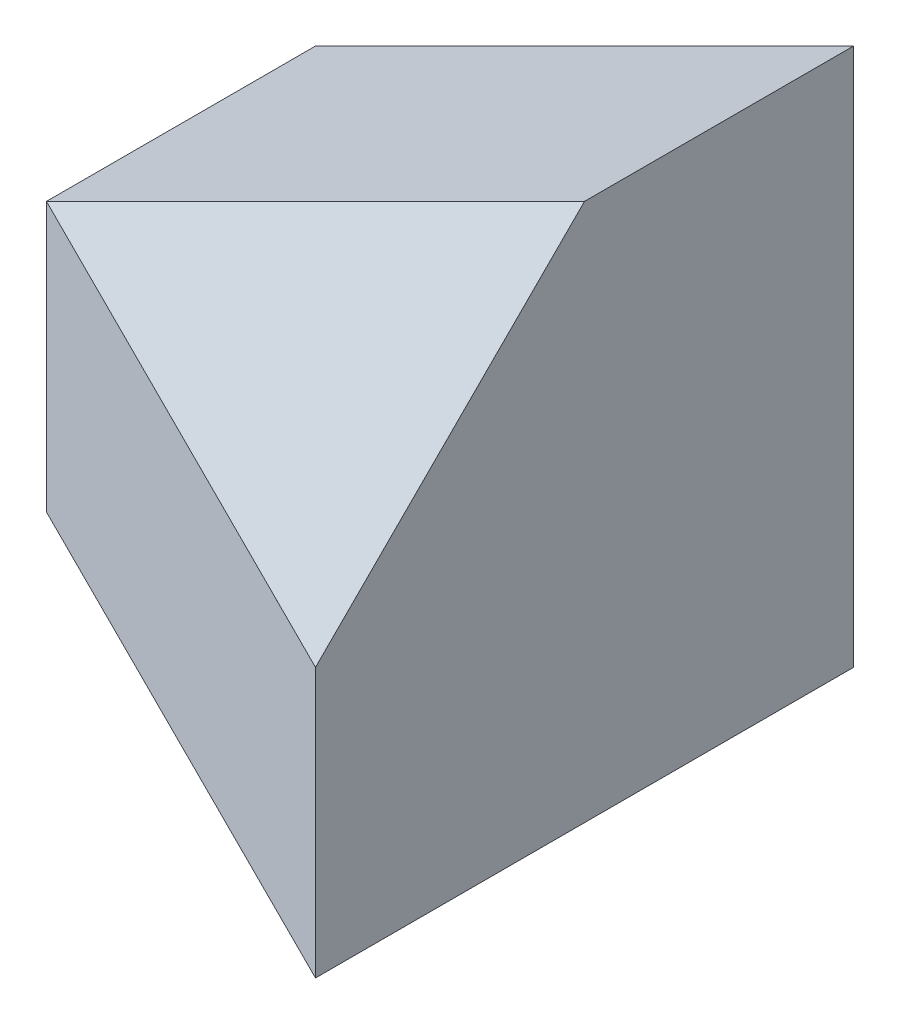
ISO-10303-21;
HEADER;
FILE_DESCRIPTION(('STEP AP214'),'2;1');
FILE_NAME('part.step','',(''),(''),'','','');
FILE_SCHEMA(('AUTOMOTIVE_DESIGN { 1 0 10303 214 1 1 1 1 }'));
ENDSEC;
DATA;
#1=APPLICATION_CONTEXT('core data for automotive mechanical design processes');
#2=APPLICATION_PROTOCOL_DEFINITION('international standard','automotive_design',2000,#1);
#3=PRODUCT_CONTEXT('',#1,'mechanical');
#4=PRODUCT('Part','Part','',(#3));
#5=PRODUCT_RELATED_PRODUCT_CATEGORY('part','',(#4));
#6=PRODUCT_DEFINITION_FORMATION('','',#4);
#7=PRODUCT_DEFINITION_CONTEXT('part definition',#1,'design');
#8=PRODUCT_DEFINITION('design','',#6,#7);
#9=PRODUCT_DEFINITION_SHAPE('','',#8);
#10=(LENGTH_UNIT() NAMED_UNIT(*) SI_UNIT(.MILLI.,.METRE.));
#11=(NAMED_UNIT(*) PLANE_ANGLE_UNIT() SI_UNIT($,.RADIAN.));
#12=(NAMED_UNIT(*) SI_UNIT($,.STERADIAN.) SOLID_ANGLE_UNIT());
#13=UNCERTAINTY_MEASURE_WITH_UNIT(LENGTH_MEASURE(1.E-05),#10,'distance_accuracy_value','');
#14=(GEOMETRIC_REPRESENTATION_CONTEXT(3) GLOBAL_UNCERTAINTY_ASSIGNED_CONTEXT((#13)) GLOBAL_UNIT_ASSIGNED_CONTEXT((#10,
#11,#12)) REPRESENTATION_CONTEXT('',''));
#15=CARTESIAN_POINT('',(0.,0.,0.));
#16=DIRECTION('',(0.,0.,1.));
#17=DIRECTION('',(1.,0.,0.));
#18=AXIS2_PLACEMENT_3D('',#15,#16,#17);
#19=CARTESIAN_POINT('',(-7.99995527864045,0.,15.9999105572809));
#20=DIRECTION('',(0.447213595499958,0.,-0.894427190999916));
#21=DIRECTION('',(-0.894427190999916,0.,-0.447213595499958));
#22=AXIS2_PLACEMENT_3D('',#19,#20,#21);
#23=PLANE('',#22);
#24=DIRECTION('',(-0.894427190999916,0.,-0.447213595499958));
#25=VECTOR('',#24,1.);
#26=CARTESIAN_POINT('',(4.47213595447916E-05,20.001,19.9999105572809));
#27=LINE('',#26,#25);
#28=CARTESIAN_POINT('',(40.,20.001,39.9998881966011));
#29=VERTEX_POINT('',#28);
#30=CARTESIAN_POINT('',(0.,20.0009105572809,20.0007881966011));
#31=VERTEX_POINT('',#30);
#32=EDGE_CURVE('E131',#29,#31,#27,.T.);
#33=ORIENTED_EDGE('',*,*,#32,.T.);
#34=DIRECTION('',(0.894427190999916,0.,0.447213595499958));
#35=VECTOR('',#34,1.);
#36=CARTESIAN_POINT('',(4.47213595447916E-05,20.,19.9999105572809));
#37=LINE('',#36,#35);
#38=CARTESIAN_POINT('',(40.,20.,39.9998881966011));
#39=VERTEX_POINT('',#38);
#40=EDGE_CURVE('E193',#31,#39,#37,.T.);
#41=ORIENTED_EDGE('',*,*,#40,.T.);
#42=DIRECTION('',(0.,-1.,0.));
#43=VECTOR('',#42,1.);
#44=CARTESIAN_POINT('',(40.,0.,39.9998881966011));
#45=LINE('',#44,#43);
#46=EDGE_CURVE('E80',#29,#39,#45,.T.);
#47=ORIENTED_EDGE('',*,*,#46,.F.);
#48=EDGE_LOOP('',(#33,#41,#47));
#49=FACE_BOUND('',#48,.T.);
#50=ADVANCED_FACE('F53',(#49),#23,.F.);
#51=CARTESIAN_POINT('',(40.,0.,40.));
#52=DIRECTION('',(-1.,0.,0.));
#53=DIRECTION('',(0.,0.,1.));
#54=AXIS2_PLACEMENT_3D('',#51,#52,#53);
#55=PLANE('',#54);
#56=DIRECTION('',(0.,1.,0.));
#57=VECTOR('',#56,1.);
#58=CARTESIAN_POINT('',(40.,20.0009105572809,0.));
#59=LINE('',#58,#57);
#60=CARTESIAN_POINT('',(40.,20.0007218933855,0.));
#61=VERTEX_POINT('',#60);
#62=CARTESIAN_POINT('',(40.,39.9999580737254,0.));
#63=VERTEX_POINT('',#62);
#64=EDGE_CURVE('E142',#61,#63,#59,.T.);
#65=ORIENTED_EDGE('',*,*,#64,.T.);
#66=CARTESIAN_POINT('',(40.,39.9999440983006,0.));
#67=DIRECTION('',(0.,0.,1.));
#68=VECTOR('',#67,1.);
#69=LINE('',#66,#68);
#70=CARTESIAN_POINT('',(40.,39.9999440983006,20.0007881966011));
#71=VERTEX_POINT('',#70);
#72=EDGE_CURVE('E124',#63,#71,#69,.T.);
#73=ORIENTED_EDGE('',*,*,#72,.T.);
#74=DIRECTION('',(0.,0.707104804666945,-0.707108757700625));
#75=VECTOR('',#74,1.);
#76=CARTESIAN_POINT('',(40.,10.0005559071337,50.0004999998437));
#77=LINE('',#76,#75);
#78=CARTESIAN_POINT('',(40.,20.001,40.));
#79=VERTEX_POINT('',#78);
#80=EDGE_CURVE('E13',#79,#71,#77,.T.);
#81=ORIENTED_EDGE('',*,*,#80,.F.);
#82=DIRECTION('',(0.,0.,-1.));
#83=VECTOR('',#82,1.);
#84=CARTESIAN_POINT('',(40.,20.001,40.));
#85=LINE('',#84,#83);
#86=EDGE_CURVE('E230',#79,#29,#85,.T.);
#87=ORIENTED_EDGE('',*,*,#86,.T.);
#88=ORIENTED_EDGE('',*,*,#46,.T.);
#89=DIRECTION('',(0.,0.,1.));
#90=VECTOR('',#89,1.);
#91=CARTESIAN_POINT('',(40.,20.,40.));
#92=LINE('',#91,#90);
#93=CARTESIAN_POINT('',(40.,20.,40.));
#94=VERTEX_POINT('',#93);
#95=EDGE_CURVE('E228',#39,#94,#92,.T.);
#96=ORIENTED_EDGE('',*,*,#95,.T.);
#97=DIRECTION('',(0.,1.,0.));
#98=VECTOR('',#97,1.);
#99=CARTESIAN_POINT('',(40.,0.,40.));
#100=LINE('',#99,#98);
#101=CARTESIAN_POINT('',(40.,0.,40.));
#102=VERTEX_POINT('',#101);
#103=EDGE_CURVE('E198',#102,#94,#100,.T.);
#104=ORIENTED_EDGE('',*,*,#103,.F.);
#105=DIRECTION('',(0.,0.,-1.));
#106=VECTOR('',#105,1.);
#107=CARTESIAN_POINT('',(40.,0.,40.));
#108=LINE('',#107,#106);
#109=CARTESIAN_POINT('',(40.,0.,0.));
#110=VERTEX_POINT('',#109);
#111=EDGE_CURVE('E223',#102,#110,#108,.T.);
#112=ORIENTED_EDGE('',*,*,#111,.T.);
#113=DIRECTION('',(0.,1.,0.));
#114=VECTOR('',#113,1.);
#115=CARTESIAN_POINT('',(40.,0.,0.));
#116=LINE('',#115,#114);
#117=EDGE_CURVE('E213',#110,#61,#116,.T.);
#118=ORIENTED_EDGE('',*,*,#117,.T.);
#119=EDGE_LOOP('',(#65,#73,#81,#87,#88,#96,#104,#112,#118));
#120=FACE_BOUND('',#119,.T.);
#121=ADVANCED_FACE('F137',(#120),#55,.F.);
#122=CARTESIAN_POINT('',(8.,40.,16.));
#123=DIRECTION('',(0.447213595499958,0.,0.894427190999916));
#124=DIRECTION('',(0.894427190999916,0.,-0.447213595499958));
#125=AXIS2_PLACEMENT_3D('',#122,#123,#124);
#126=PLANE('',#125);
#127=DIRECTION('',(0.,-1.,0.));
#128=VECTOR('',#127,1.);
#129=CARTESIAN_POINT('',(0.,40.,20.));
#130=LINE('',#129,#128);
#131=CARTESIAN_POINT('',(0.,0.,20.));
#132=VERTEX_POINT('',#131);
#133=EDGE_CURVE('E196',#31,#132,#130,.T.);
#134=ORIENTED_EDGE('',*,*,#133,.F.);
#135=DIRECTION('',(0.894427190999916,0.,-0.447213595499958));
#136=VECTOR('',#135,1.);
#137=CARTESIAN_POINT('',(8.,20.0009105572809,16.));
#138=LINE('',#137,#136);
#139=EDGE_CURVE('E231',#31,#61,#138,.T.);
#140=ORIENTED_EDGE('',*,*,#139,.T.);
#141=ORIENTED_EDGE('',*,*,#117,.F.);
#142=DIRECTION('',(-0.894427190999916,0.,0.447213595499958));
#143=VECTOR('',#142,1.);
#144=CARTESIAN_POINT('',(8.,0.,16.));
#145=LINE('',#144,#143);
#146=EDGE_CURVE('E209',#110,#132,#145,.T.);
#147=ORIENTED_EDGE('',*,*,#146,.T.);
#148=EDGE_LOOP('',(#134,#140,#141,#147));
#149=FACE_BOUND('',#148,.T.);
#150=ADVANCED_FACE('F166',(#149),#126,.F.);
#151=CARTESIAN_POINT('',(-8.,40.,16.));
#152=DIRECTION('',(0.447213595499958,0.,-0.894427190999916));
#153=DIRECTION('',(-0.894427190999916,0.,-0.447213595499958));
#154=AXIS2_PLACEMENT_3D('',#151,#152,#153);
#155=PLANE('',#154);
#156=ORIENTED_EDGE('',*,*,#103,.T.);
#157=DIRECTION('',(0.894427190999916,0.,0.447213595499958));
#158=VECTOR('',#157,1.);
#159=CARTESIAN_POINT('',(0.,20.,20.));
#160=LINE('',#159,#158);
#161=EDGE_CURVE('E91',#31,#94,#160,.T.);
#162=ORIENTED_EDGE('',*,*,#161,.F.);
#163=ORIENTED_EDGE('',*,*,#133,.T.);
#164=DIRECTION('',(0.894427190999916,0.,0.447213595499958));
#165=VECTOR('',#164,1.);
#166=CARTESIAN_POINT('',(-8.,0.,16.));
#167=LINE('',#166,#165);
#168=EDGE_CURVE('E100',#132,#102,#167,.T.);
#169=ORIENTED_EDGE('',*,*,#168,.T.);
#170=EDGE_LOOP('',(#156,#162,#163,#169));
#171=FACE_BOUND('',#170,.T.);
#172=ADVANCED_FACE('F55',(#171),#155,.F.);
#173=CARTESIAN_POINT('',(0.,0.,40.));
#174=DIRECTION('',(0.,1.,0.));
#175=DIRECTION('',(0.,0.,1.));
#176=AXIS2_PLACEMENT_3D('',#173,#174,#175);
#177=PLANE('',#176);
#178=ORIENTED_EDGE('',*,*,#111,.F.);
#179=ORIENTED_EDGE('',*,*,#168,.F.);
#180=ORIENTED_EDGE('',*,*,#146,.F.);
#181=EDGE_LOOP('',(#178,#179,#180));
#182=FACE_BOUND('',#181,.T.);
#183=ADVANCED_FACE('F169',(#182),#177,.F.);
#184=CARTESIAN_POINT('',(4.47213595447916E-05,20.001,19.9999105572809));
#185=DIRECTION('',(0.,1.,0.));
#186=DIRECTION('',(0.,0.,1.));
#187=AXIS2_PLACEMENT_3D('',#184,#185,#186);
#188=PLANE('',#187);
#189=DIRECTION('',(-0.894427190999916,0.,-0.447213595499958));
#190=VECTOR('',#189,1.);
#191=CARTESIAN_POINT('',(0.,20.001,20.));
#192=LINE('',#191,#190);
#193=EDGE_CURVE('E71',#79,#31,#192,.T.);
#194=ORIENTED_EDGE('',*,*,#193,.T.);
#195=ORIENTED_EDGE('',*,*,#32,.F.);
#196=ORIENTED_EDGE('',*,*,#86,.F.);
#197=EDGE_LOOP('',(#194,#195,#196));
#198=FACE_BOUND('',#197,.T.);
#199=ADVANCED_FACE('F158',(#198),#188,.F.);
#200=CARTESIAN_POINT('',(4.47213595447916E-05,20.,19.9999105572809));
#201=DIRECTION('',(0.,-1.,0.));
#202=DIRECTION('',(0.,0.,-1.));
#203=AXIS2_PLACEMENT_3D('',#200,#201,#202);
#204=PLANE('',#203);
#205=ORIENTED_EDGE('',*,*,#40,.F.);
#206=ORIENTED_EDGE('',*,*,#161,.T.);
#207=ORIENTED_EDGE('',*,*,#95,.F.);
#208=EDGE_LOOP('',(#205,#206,#207));
#209=FACE_BOUND('',#208,.T.);
#210=ADVANCED_FACE('F149',(#209),#204,.F.);
#211=CARTESIAN_POINT('',(-8.88909178621121,17.7782829604592,17.7781835724224));
#212=DIRECTION('',(-0.33333250511937,0.666668737195788,0.66666501023874));
#213=DIRECTION('',(0.,-0.707104804666947,0.707108757700623));
#214=AXIS2_PLACEMENT_3D('',#211,#212,#213);
#215=PLANE('',#214);
#216=ORIENTED_EDGE('',*,*,#80,.T.);
#217=CARTESIAN_POINT('',(40.,40.,20.0008881966011));
#218=DIRECTION('',(-0.89442719099712,-0.447213595498561,2.50012500532872E-06));
#219=VECTOR('',#218,1.);
#220=LINE('',#217,#219);
#221=EDGE_CURVE('E64',#71,#31,#220,.T.);
#222=ORIENTED_EDGE('',*,*,#221,.T.);
#223=ORIENTED_EDGE('',*,*,#193,.F.);
#224=EDGE_LOOP('',(#216,#222,#223));
#225=FACE_BOUND('',#224,.T.);
#226=ADVANCED_FACE('F146',(#225),#215,.T.);
#227=CARTESIAN_POINT('',(0.,20.0009105572809,0.));
#228=DIRECTION('',(0.,0.,-1.));
#229=DIRECTION('',(-1.,0.,0.));
#230=AXIS2_PLACEMENT_3D('',#227,#228,#229);
#231=PLANE('',#230);
#232=DIRECTION('',(-0.894435835188279,-0.447196306705508,0.));
#233=VECTOR('',#232,1.);
#234=CARTESIAN_POINT('',(0.,20.0009105572809,0.));
#235=LINE('',#234,#233);
#236=CARTESIAN_POINT('',(0.,20.0009105572809,-0.00367661816893204));
#237=VERTEX_POINT('',#236);
#238=EDGE_CURVE('E143',#63,#237,#235,.T.);
#239=ORIENTED_EDGE('',*,*,#238,.F.);
#240=ORIENTED_EDGE('',*,*,#64,.F.);
#241=DIRECTION('',(1.,0.,0.));
#242=VECTOR('',#241,1.);
#243=CARTESIAN_POINT('',(0.,20.0009105572809,0.));
#244=LINE('',#243,#242);
#245=EDGE_CURVE('E234',#237,#61,#244,.T.);
#246=ORIENTED_EDGE('',*,*,#245,.F.);
#247=EDGE_LOOP('',(#239,#240,#246));
#248=FACE_BOUND('',#247,.T.);
#249=ADVANCED_FACE('F148',(#248),#231,.T.);
#250=CARTESIAN_POINT('',(0.,20.0009105572809,20.0007881966011));
#251=DIRECTION('',(0.,-1.,0.));
#252=DIRECTION('',(0.,0.,-1.));
#253=AXIS2_PLACEMENT_3D('',#250,#251,#252);
#254=PLANE('',#253);
#255=ORIENTED_EDGE('',*,*,#139,.F.);
#256=CARTESIAN_POINT('',(0.,20.0009105572809,-0.00735323633785714));
#257=DIRECTION('',(0.,0.,1.));
#258=VECTOR('',#257,1.);
#259=LINE('',#256,#258);
#260=EDGE_CURVE('E128',#237,#31,#259,.T.);
#261=ORIENTED_EDGE('',*,*,#260,.F.);
#262=ORIENTED_EDGE('',*,*,#245,.T.);
#263=EDGE_LOOP('',(#255,#261,#262));
#264=FACE_BOUND('',#263,.T.);
#265=ADVANCED_FACE('F155',(#264),#254,.T.);
#266=CARTESIAN_POINT('',(40.,39.9999440983006,-19.9992118033989));
#267=DIRECTION('',(0.447196306705508,-0.894435835188278,0.));
#268=DIRECTION('',(0.894435835188279,0.447196306705508,0.));
#269=AXIS2_PLACEMENT_3D('',#266,#267,#268);
#270=PLANE('',#269);
#271=ORIENTED_EDGE('',*,*,#238,.T.);
#272=ORIENTED_EDGE('',*,*,#260,.T.);
#273=ORIENTED_EDGE('',*,*,#221,.F.);
#274=ORIENTED_EDGE('',*,*,#72,.F.);
#275=EDGE_LOOP('',(#271,#272,#273,#274));
#276=FACE_BOUND('',#275,.T.);
#277=ADVANCED_FACE('F123',(#276),#270,.F.);
#278=CLOSED_SHELL('',(#50,#121,#150,#172,#183,#199,#210,#226,#249,#265,#277));
#279=MANIFOLD_SOLID_BREP('B2',#278);
#280=ADVANCED_BREP_SHAPE_REPRESENTATION('',(#18,#279),#14);
#281=SHAPE_DEFINITION_REPRESENTATION(#9,#280);
ENDSEC;
END-ISO-10303-21;
